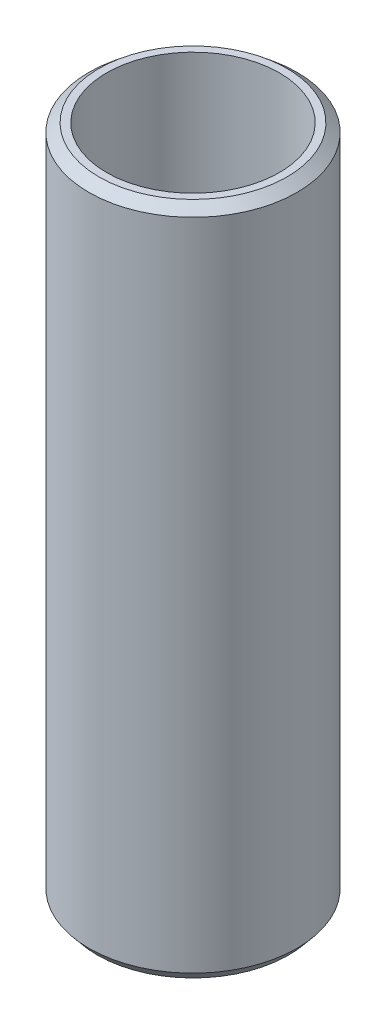
ISO-10303-21;
HEADER;
FILE_DESCRIPTION(('STEP AP214'),'2;1');
FILE_NAME('part.step','',(''),(''),'','','');
FILE_SCHEMA(('AUTOMOTIVE_DESIGN { 1 0 10303 214 1 1 1 1 }'));
ENDSEC;
DATA;
#1=APPLICATION_CONTEXT('core data for automotive mechanical design processes');
#2=APPLICATION_PROTOCOL_DEFINITION('international standard','automotive_design',2000,#1);
#3=PRODUCT_CONTEXT('',#1,'mechanical');
#4=PRODUCT('Part','Part','',(#3));
#5=PRODUCT_RELATED_PRODUCT_CATEGORY('part','',(#4));
#6=PRODUCT_DEFINITION_FORMATION('','',#4);
#7=PRODUCT_DEFINITION_CONTEXT('part definition',#1,'design');
#8=PRODUCT_DEFINITION('design','',#6,#7);
#9=PRODUCT_DEFINITION_SHAPE('','',#8);
#10=(LENGTH_UNIT() NAMED_UNIT(*) SI_UNIT(.MILLI.,.METRE.));
#11=(NAMED_UNIT(*) PLANE_ANGLE_UNIT() SI_UNIT($,.RADIAN.));
#12=(NAMED_UNIT(*) SI_UNIT($,.STERADIAN.) SOLID_ANGLE_UNIT());
#13=UNCERTAINTY_MEASURE_WITH_UNIT(LENGTH_MEASURE(1.E-05),#10,'distance_accuracy_value','');
#14=(GEOMETRIC_REPRESENTATION_CONTEXT(3) GLOBAL_UNCERTAINTY_ASSIGNED_CONTEXT((#13)) GLOBAL_UNIT_ASSIGNED_CONTEXT((#10,
#11,#12)) REPRESENTATION_CONTEXT('',''));
#15=CARTESIAN_POINT('',(0.,0.,0.));
#16=DIRECTION('',(0.,0.,1.));
#17=DIRECTION('',(1.,0.,0.));
#18=AXIS2_PLACEMENT_3D('',#15,#16,#17);
#19=CARTESIAN_POINT('',(0.,323.355413503651,0.));
#20=DIRECTION('',(0.,-1.,0.));
#21=DIRECTION('',(0.,0.,-1.));
#22=AXIS2_PLACEMENT_3D('',#19,#20,#21);
#23=CYLINDRICAL_SURFACE('',#22,50.);
#24=CARTESIAN_POINT('',(0.,319.334762838025,0.));
#25=DIRECTION('',(0.,1.,0.));
#26=DIRECTION('',(0.,0.,1.));
#27=AXIS2_PLACEMENT_3D('',#24,#25,#26);
#28=CIRCLE('',#27,50.);
#29=CARTESIAN_POINT('',(0.,319.334762838025,50.));
#30=VERTEX_POINT('',#29);
#31=EDGE_CURVE('E50',#30,#30,#28,.F.);
#32=ORIENTED_EDGE('',*,*,#31,.T.);
#33=EDGE_LOOP('',(#32));
#34=FACE_BOUND('',#33,.T.);
#35=CARTESIAN_POINT('',(0.,4.83549913246167,0.));
#36=DIRECTION('',(0.,1.,0.));
#37=DIRECTION('',(0.,0.,1.));
#38=AXIS2_PLACEMENT_3D('',#35,#36,#37);
#39=CIRCLE('',#38,50.);
#40=CARTESIAN_POINT('',(0.,4.83549913246167,50.));
#41=VERTEX_POINT('',#40);
#42=EDGE_CURVE('E51',#41,#41,#39,.T.);
#43=ORIENTED_EDGE('',*,*,#42,.T.);
#44=EDGE_LOOP('',(#43));
#45=FACE_BOUND('',#44,.T.);
#46=ADVANCED_FACE('F39',(#34,#45),#23,.T.);
#47=CARTESIAN_POINT('',(0.,323.355413503651,0.));
#48=DIRECTION('',(0.,1.,0.));
#49=DIRECTION('',(0.,0.,1.));
#50=AXIS2_PLACEMENT_3D('',#47,#48,#49);
#51=PLANE('',#50);
#52=CARTESIAN_POINT('',(0.,323.355413503651,0.));
#53=DIRECTION('',(0.,1.,0.));
#54=DIRECTION('',(0.,0.,1.));
#55=AXIS2_PLACEMENT_3D('',#52,#53,#54);
#56=CIRCLE('',#55,45.1645008675384);
#57=CARTESIAN_POINT('',(0.,323.355413503651,45.1645008675384));
#58=VERTEX_POINT('',#57);
#59=EDGE_CURVE('E54',#58,#58,#56,.T.);
#60=ORIENTED_EDGE('',*,*,#59,.T.);
#61=EDGE_LOOP('',(#60));
#62=FACE_BOUND('',#61,.T.);
#63=CARTESIAN_POINT('',(0.,323.355413503651,0.));
#64=DIRECTION('',(0.,1.,0.));
#65=DIRECTION('',(0.,0.,1.));
#66=AXIS2_PLACEMENT_3D('',#63,#64,#65);
#67=CIRCLE('',#66,41.5182812506156);
#68=CARTESIAN_POINT('',(0.,323.355413503651,41.5182812506156));
#69=VERTEX_POINT('',#68);
#70=EDGE_CURVE('E58',#69,#69,#67,.T.);
#71=ORIENTED_EDGE('',*,*,#70,.F.);
#72=EDGE_LOOP('',(#71));
#73=FACE_BOUND('',#72,.T.);
#74=ADVANCED_FACE('F69',(#62,#73),#51,.T.);
#75=CARTESIAN_POINT('',(0.,0.,0.));
#76=DIRECTION('',(0.,1.,0.));
#77=DIRECTION('',(0.,0.,1.));
#78=AXIS2_PLACEMENT_3D('',#75,#76,#77);
#79=PLANE('',#78);
#80=CARTESIAN_POINT('',(0.,0.,0.));
#81=DIRECTION('',(0.,1.,0.));
#82=DIRECTION('',(0.,0.,1.));
#83=AXIS2_PLACEMENT_3D('',#80,#81,#82);
#84=CIRCLE('',#83,45.9793493343741);
#85=CARTESIAN_POINT('',(0.,0.,45.9793493343741));
#86=VERTEX_POINT('',#85);
#87=EDGE_CURVE('E10',#86,#86,#84,.F.);
#88=ORIENTED_EDGE('',*,*,#87,.T.);
#89=EDGE_LOOP('',(#88));
#90=FACE_BOUND('',#89,.T.);
#91=CARTESIAN_POINT('',(0.,0.,0.));
#92=DIRECTION('',(0.,1.,0.));
#93=DIRECTION('',(0.,0.,1.));
#94=AXIS2_PLACEMENT_3D('',#91,#92,#93);
#95=CIRCLE('',#94,41.5182812506156);
#96=CARTESIAN_POINT('',(0.,0.,41.5182812506156));
#97=VERTEX_POINT('',#96);
#98=EDGE_CURVE('E63',#97,#97,#95,.T.);
#99=ORIENTED_EDGE('',*,*,#98,.T.);
#100=EDGE_LOOP('',(#99));
#101=FACE_BOUND('',#100,.T.);
#102=ADVANCED_FACE('F75',(#90,#101),#79,.F.);
#103=CARTESIAN_POINT('',(0.,323.355413503651,0.));
#104=DIRECTION('',(0.,-1.,0.));
#105=DIRECTION('',(0.,0.,-1.));
#106=AXIS2_PLACEMENT_3D('',#103,#104,#105);
#107=CYLINDRICAL_SURFACE('',#106,41.5182812506156);
#108=ORIENTED_EDGE('',*,*,#70,.T.);
#109=EDGE_LOOP('',(#108));
#110=FACE_BOUND('',#109,.T.);
#111=ORIENTED_EDGE('',*,*,#98,.F.);
#112=EDGE_LOOP('',(#111));
#113=FACE_BOUND('',#112,.T.);
#114=ADVANCED_FACE('F70',(#110,#113),#107,.F.);
#115=CARTESIAN_POINT('',(0.,323.355413503651,0.));
#116=DIRECTION('',(0.,-1.,0.));
#117=DIRECTION('',(0.,0.,-1.));
#118=AXIS2_PLACEMENT_3D('',#115,#116,#117);
#119=CONICAL_SURFACE('',#118,45.1645008675384,0.877149169104463);
#120=ORIENTED_EDGE('',*,*,#31,.F.);
#121=EDGE_LOOP('',(#120));
#122=FACE_BOUND('',#121,.T.);
#123=ORIENTED_EDGE('',*,*,#59,.F.);
#124=EDGE_LOOP('',(#123));
#125=FACE_BOUND('',#124,.T.);
#126=ADVANCED_FACE('F81',(#122,#125),#119,.T.);
#127=CARTESIAN_POINT('',(0.,4.83549913246167,0.));
#128=DIRECTION('',(0.,1.,0.));
#129=DIRECTION('',(0.,0.,1.));
#130=AXIS2_PLACEMENT_3D('',#127,#128,#129);
#131=CONICAL_SURFACE('',#130,50.,0.693647157690435);
#132=ORIENTED_EDGE('',*,*,#87,.F.);
#133=EDGE_LOOP('',(#132));
#134=FACE_BOUND('',#133,.T.);
#135=ORIENTED_EDGE('',*,*,#42,.F.);
#136=EDGE_LOOP('',(#135));
#137=FACE_BOUND('',#136,.T.);
#138=ADVANCED_FACE('F45',(#134,#137),#131,.T.);
#139=CLOSED_SHELL('',(#46,#74,#102,#114,#126,#138));
#140=MANIFOLD_SOLID_BREP('B2',#139);
#141=ADVANCED_BREP_SHAPE_REPRESENTATION('',(#18,#140),#14);
#142=SHAPE_DEFINITION_REPRESENTATION(#9,#141);
ENDSEC;
END-ISO-10303-21;
